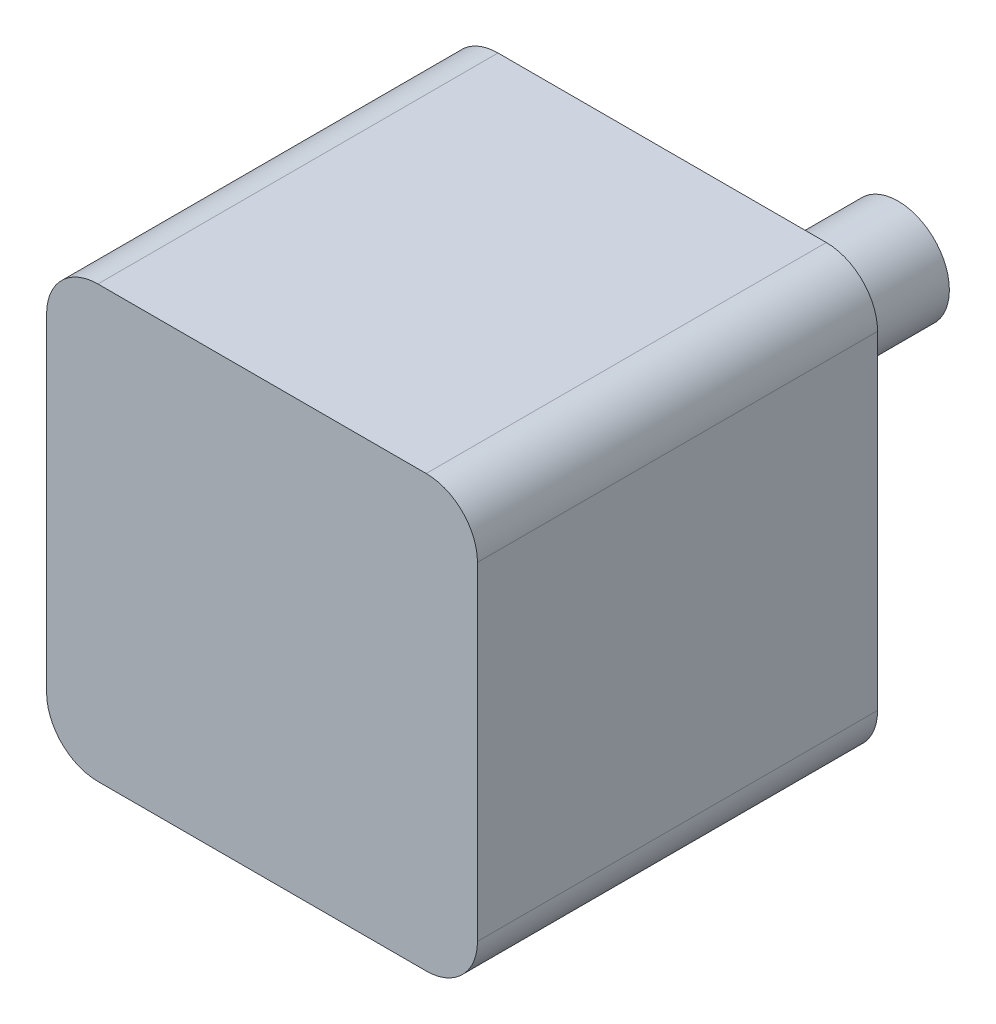
ISO-10303-21;
HEADER;
FILE_DESCRIPTION(('STEP AP214'),'2;1');
FILE_NAME('part.step','',(''),(''),'','','');
FILE_SCHEMA(('AUTOMOTIVE_DESIGN { 1 0 10303 214 1 1 1 1 }'));
ENDSEC;
DATA;
#1=APPLICATION_CONTEXT('core data for automotive mechanical design processes');
#2=APPLICATION_PROTOCOL_DEFINITION('international standard','automotive_design',2000,#1);
#3=PRODUCT_CONTEXT('',#1,'mechanical');
#4=PRODUCT('Part','Part','',(#3));
#5=PRODUCT_RELATED_PRODUCT_CATEGORY('part','',(#4));
#6=PRODUCT_DEFINITION_FORMATION('','',#4);
#7=PRODUCT_DEFINITION_CONTEXT('part definition',#1,'design');
#8=PRODUCT_DEFINITION('design','',#6,#7);
#9=PRODUCT_DEFINITION_SHAPE('','',#8);
#10=(LENGTH_UNIT() NAMED_UNIT(*) SI_UNIT(.MILLI.,.METRE.));
#11=(NAMED_UNIT(*) PLANE_ANGLE_UNIT() SI_UNIT($,.RADIAN.));
#12=(NAMED_UNIT(*) SI_UNIT($,.STERADIAN.) SOLID_ANGLE_UNIT());
#13=UNCERTAINTY_MEASURE_WITH_UNIT(LENGTH_MEASURE(1.E-05),#10,'distance_accuracy_value','');
#14=(GEOMETRIC_REPRESENTATION_CONTEXT(3) GLOBAL_UNCERTAINTY_ASSIGNED_CONTEXT((#13)) GLOBAL_UNIT_ASSIGNED_CONTEXT((#10,
#11,#12)) REPRESENTATION_CONTEXT('',''));
#15=CARTESIAN_POINT('',(0.,0.,0.));
#16=DIRECTION('',(0.,0.,1.));
#17=DIRECTION('',(1.,0.,0.));
#18=AXIS2_PLACEMENT_3D('',#15,#16,#17);
#19=CARTESIAN_POINT('',(0.,0.,0.));
#20=DIRECTION('',(0.,0.,1.));
#21=DIRECTION('',(1.,0.,0.));
#22=AXIS2_PLACEMENT_3D('',#19,#20,#21);
#23=PLANE('',#22);
#24=DIRECTION('',(0.,1.,0.));
#25=VECTOR('',#24,1.);
#26=CARTESIAN_POINT('',(42.,0.,0.));
#27=LINE('',#26,#25);
#28=CARTESIAN_POINT('',(42.,-37.,0.));
#29=VERTEX_POINT('',#28);
#30=CARTESIAN_POINT('',(42.,-5.,0.));
#31=VERTEX_POINT('',#30);
#32=EDGE_CURVE('E116',#29,#31,#27,.T.);
#33=ORIENTED_EDGE('',*,*,#32,.F.);
#34=CARTESIAN_POINT('',(37.,-37.,0.));
#35=DIRECTION('',(0.,0.,1.));
#36=DIRECTION('',(1.,0.,0.));
#37=AXIS2_PLACEMENT_3D('',#34,#35,#36);
#38=CIRCLE('',#37,5.);
#39=CARTESIAN_POINT('',(37.,-42.,0.));
#40=VERTEX_POINT('',#39);
#41=EDGE_CURVE('E99',#29,#40,#38,.F.);
#42=ORIENTED_EDGE('',*,*,#41,.T.);
#43=DIRECTION('',(1.,0.,0.));
#44=VECTOR('',#43,1.);
#45=CARTESIAN_POINT('',(0.,-42.,0.));
#46=LINE('',#45,#44);
#47=CARTESIAN_POINT('',(5.,-42.,0.));
#48=VERTEX_POINT('',#47);
#49=EDGE_CURVE('E125',#48,#40,#46,.T.);
#50=ORIENTED_EDGE('',*,*,#49,.F.);
#51=CARTESIAN_POINT('',(5.,-37.,0.));
#52=DIRECTION('',(0.,0.,1.));
#53=DIRECTION('',(1.,0.,0.));
#54=AXIS2_PLACEMENT_3D('',#51,#52,#53);
#55=CIRCLE('',#54,5.);
#56=CARTESIAN_POINT('',(0.,-37.,0.));
#57=VERTEX_POINT('',#56);
#58=EDGE_CURVE('E110',#48,#57,#55,.F.);
#59=ORIENTED_EDGE('',*,*,#58,.T.);
#60=DIRECTION('',(0.,-1.,0.));
#61=VECTOR('',#60,1.);
#62=CARTESIAN_POINT('',(0.,0.,0.));
#63=LINE('',#62,#61);
#64=CARTESIAN_POINT('',(0.,-5.,0.));
#65=VERTEX_POINT('',#64);
#66=EDGE_CURVE('E129',#65,#57,#63,.T.);
#67=ORIENTED_EDGE('',*,*,#66,.F.);
#68=CARTESIAN_POINT('',(5.,-5.,0.));
#69=DIRECTION('',(0.,0.,1.));
#70=DIRECTION('',(1.,0.,0.));
#71=AXIS2_PLACEMENT_3D('',#68,#69,#70);
#72=CIRCLE('',#71,5.);
#73=CARTESIAN_POINT('',(5.,0.,0.));
#74=VERTEX_POINT('',#73);
#75=EDGE_CURVE('E136',#65,#74,#72,.F.);
#76=ORIENTED_EDGE('',*,*,#75,.T.);
#77=DIRECTION('',(-1.,0.,0.));
#78=VECTOR('',#77,1.);
#79=CARTESIAN_POINT('',(0.,0.,0.));
#80=LINE('',#79,#78);
#81=CARTESIAN_POINT('',(37.,0.,0.));
#82=VERTEX_POINT('',#81);
#83=EDGE_CURVE('E124',#82,#74,#80,.T.);
#84=ORIENTED_EDGE('',*,*,#83,.F.);
#85=CARTESIAN_POINT('',(37.,-5.,0.));
#86=DIRECTION('',(0.,0.,1.));
#87=DIRECTION('',(1.,0.,0.));
#88=AXIS2_PLACEMENT_3D('',#85,#86,#87);
#89=CIRCLE('',#88,5.);
#90=EDGE_CURVE('E119',#82,#31,#89,.F.);
#91=ORIENTED_EDGE('',*,*,#90,.T.);
#92=EDGE_LOOP('',(#33,#42,#50,#59,#67,#76,#84,#91));
#93=FACE_BOUND('',#92,.T.);
#94=CARTESIAN_POINT('',(21.,-21.,0.));
#95=DIRECTION('',(0.,0.,1.));
#96=DIRECTION('',(1.,0.,0.));
#97=AXIS2_PLACEMENT_3D('',#94,#95,#96);
#98=CIRCLE('',#97,5.);
#99=CARTESIAN_POINT('',(26.,-21.,0.));
#100=VERTEX_POINT('',#99);
#101=EDGE_CURVE('E11',#100,#100,#98,.F.);
#102=ORIENTED_EDGE('',*,*,#101,.F.);
#103=EDGE_LOOP('',(#102));
#104=FACE_BOUND('',#103,.T.);
#105=ADVANCED_FACE('F33',(#93,#104),#23,.F.);
#106=CARTESIAN_POINT('',(0.,0.,39.));
#107=DIRECTION('',(1.,0.,0.));
#108=DIRECTION('',(0.,1.,0.));
#109=AXIS2_PLACEMENT_3D('',#106,#107,#108);
#110=PLANE('',#109);
#111=ORIENTED_EDGE('',*,*,#66,.T.);
#112=DIRECTION('',(0.,0.,-1.));
#113=VECTOR('',#112,1.);
#114=CARTESIAN_POINT('',(0.,-37.,39.));
#115=LINE('',#114,#113);
#116=CARTESIAN_POINT('',(0.,-37.,39.));
#117=VERTEX_POINT('',#116);
#118=EDGE_CURVE('E152',#57,#117,#115,.F.);
#119=ORIENTED_EDGE('',*,*,#118,.T.);
#120=DIRECTION('',(0.,-1.,0.));
#121=VECTOR('',#120,1.);
#122=CARTESIAN_POINT('',(0.,0.,39.));
#123=LINE('',#122,#121);
#124=CARTESIAN_POINT('',(0.,-5.,39.));
#125=VERTEX_POINT('',#124);
#126=EDGE_CURVE('E127',#125,#117,#123,.T.);
#127=ORIENTED_EDGE('',*,*,#126,.F.);
#128=DIRECTION('',(0.,0.,-1.));
#129=VECTOR('',#128,1.);
#130=CARTESIAN_POINT('',(0.,-5.,39.));
#131=LINE('',#130,#129);
#132=EDGE_CURVE('E149',#125,#65,#131,.T.);
#133=ORIENTED_EDGE('',*,*,#132,.T.);
#134=EDGE_LOOP('',(#111,#119,#127,#133));
#135=FACE_BOUND('',#134,.T.);
#136=ADVANCED_FACE('F167',(#135),#110,.F.);
#137=CARTESIAN_POINT('',(0.,-42.,39.));
#138=DIRECTION('',(0.,1.,0.));
#139=DIRECTION('',(0.,0.,1.));
#140=AXIS2_PLACEMENT_3D('',#137,#138,#139);
#141=PLANE('',#140);
#142=ORIENTED_EDGE('',*,*,#49,.T.);
#143=DIRECTION('',(0.,0.,-1.));
#144=VECTOR('',#143,1.);
#145=CARTESIAN_POINT('',(37.,-42.,39.));
#146=LINE('',#145,#144);
#147=CARTESIAN_POINT('',(37.,-42.,39.));
#148=VERTEX_POINT('',#147);
#149=EDGE_CURVE('E104',#40,#148,#146,.F.);
#150=ORIENTED_EDGE('',*,*,#149,.T.);
#151=DIRECTION('',(1.,0.,0.));
#152=VECTOR('',#151,1.);
#153=CARTESIAN_POINT('',(0.,-42.,39.));
#154=LINE('',#153,#152);
#155=CARTESIAN_POINT('',(5.,-42.,39.));
#156=VERTEX_POINT('',#155);
#157=EDGE_CURVE('E171',#156,#148,#154,.T.);
#158=ORIENTED_EDGE('',*,*,#157,.F.);
#159=DIRECTION('',(0.,0.,-1.));
#160=VECTOR('',#159,1.);
#161=CARTESIAN_POINT('',(5.,-42.,39.));
#162=LINE('',#161,#160);
#163=EDGE_CURVE('E109',#156,#48,#162,.T.);
#164=ORIENTED_EDGE('',*,*,#163,.T.);
#165=EDGE_LOOP('',(#142,#150,#158,#164));
#166=FACE_BOUND('',#165,.T.);
#167=ADVANCED_FACE('F194',(#166),#141,.F.);
#168=CARTESIAN_POINT('',(42.,0.,39.));
#169=DIRECTION('',(-1.,0.,0.));
#170=DIRECTION('',(0.,-1.,0.));
#171=AXIS2_PLACEMENT_3D('',#168,#169,#170);
#172=PLANE('',#171);
#173=DIRECTION('',(0.,1.,0.));
#174=VECTOR('',#173,1.);
#175=CARTESIAN_POINT('',(42.,0.,39.));
#176=LINE('',#175,#174);
#177=CARTESIAN_POINT('',(42.,-37.,39.));
#178=VERTEX_POINT('',#177);
#179=CARTESIAN_POINT('',(42.,-5.,39.));
#180=VERTEX_POINT('',#179);
#181=EDGE_CURVE('E118',#178,#180,#176,.T.);
#182=ORIENTED_EDGE('',*,*,#181,.F.);
#183=DIRECTION('',(0.,0.,-1.));
#184=VECTOR('',#183,1.);
#185=CARTESIAN_POINT('',(42.,-37.,39.));
#186=LINE('',#185,#184);
#187=EDGE_CURVE('E103',#178,#29,#186,.T.);
#188=ORIENTED_EDGE('',*,*,#187,.T.);
#189=ORIENTED_EDGE('',*,*,#32,.T.);
#190=DIRECTION('',(0.,0.,-1.));
#191=VECTOR('',#190,1.);
#192=CARTESIAN_POINT('',(42.,-5.,39.));
#193=LINE('',#192,#191);
#194=EDGE_CURVE('E120',#31,#180,#193,.F.);
#195=ORIENTED_EDGE('',*,*,#194,.T.);
#196=EDGE_LOOP('',(#182,#188,#189,#195));
#197=FACE_BOUND('',#196,.T.);
#198=ADVANCED_FACE('F115',(#197),#172,.F.);
#199=CARTESIAN_POINT('',(0.,0.,39.));
#200=DIRECTION('',(0.,-1.,0.));
#201=DIRECTION('',(0.,0.,-1.));
#202=AXIS2_PLACEMENT_3D('',#199,#200,#201);
#203=PLANE('',#202);
#204=ORIENTED_EDGE('',*,*,#83,.T.);
#205=DIRECTION('',(0.,0.,-1.));
#206=VECTOR('',#205,1.);
#207=CARTESIAN_POINT('',(5.,0.,39.));
#208=LINE('',#207,#206);
#209=CARTESIAN_POINT('',(5.,0.,39.));
#210=VERTEX_POINT('',#209);
#211=EDGE_CURVE('E41',#74,#210,#208,.F.);
#212=ORIENTED_EDGE('',*,*,#211,.T.);
#213=DIRECTION('',(-1.,0.,0.));
#214=VECTOR('',#213,1.);
#215=CARTESIAN_POINT('',(0.,0.,39.));
#216=LINE('',#215,#214);
#217=CARTESIAN_POINT('',(37.,0.,39.));
#218=VERTEX_POINT('',#217);
#219=EDGE_CURVE('E133',#218,#210,#216,.T.);
#220=ORIENTED_EDGE('',*,*,#219,.F.);
#221=DIRECTION('',(0.,0.,-1.));
#222=VECTOR('',#221,1.);
#223=CARTESIAN_POINT('',(37.,0.,39.));
#224=LINE('',#223,#222);
#225=EDGE_CURVE('E154',#218,#82,#224,.T.);
#226=ORIENTED_EDGE('',*,*,#225,.T.);
#227=EDGE_LOOP('',(#204,#212,#220,#226));
#228=FACE_BOUND('',#227,.T.);
#229=ADVANCED_FACE('F157',(#228),#203,.F.);
#230=CARTESIAN_POINT('',(0.,0.,39.));
#231=DIRECTION('',(0.,0.,1.));
#232=DIRECTION('',(1.,0.,0.));
#233=AXIS2_PLACEMENT_3D('',#230,#231,#232);
#234=PLANE('',#233);
#235=ORIENTED_EDGE('',*,*,#157,.T.);
#236=CARTESIAN_POINT('',(37.,-37.,39.));
#237=DIRECTION('',(0.,0.,1.));
#238=DIRECTION('',(1.,0.,0.));
#239=AXIS2_PLACEMENT_3D('',#236,#237,#238);
#240=CIRCLE('',#239,5.);
#241=EDGE_CURVE('E147',#148,#178,#240,.T.);
#242=ORIENTED_EDGE('',*,*,#241,.T.);
#243=ORIENTED_EDGE('',*,*,#181,.T.);
#244=CARTESIAN_POINT('',(37.,-5.,39.));
#245=DIRECTION('',(0.,0.,1.));
#246=DIRECTION('',(1.,0.,0.));
#247=AXIS2_PLACEMENT_3D('',#244,#245,#246);
#248=CIRCLE('',#247,5.);
#249=EDGE_CURVE('E54',#180,#218,#248,.T.);
#250=ORIENTED_EDGE('',*,*,#249,.T.);
#251=ORIENTED_EDGE('',*,*,#219,.T.);
#252=CARTESIAN_POINT('',(5.,-5.,39.));
#253=DIRECTION('',(0.,0.,1.));
#254=DIRECTION('',(1.,0.,0.));
#255=AXIS2_PLACEMENT_3D('',#252,#253,#254);
#256=CIRCLE('',#255,5.);
#257=EDGE_CURVE('E143',#210,#125,#256,.T.);
#258=ORIENTED_EDGE('',*,*,#257,.T.);
#259=ORIENTED_EDGE('',*,*,#126,.T.);
#260=CARTESIAN_POINT('',(5.,-37.,39.));
#261=DIRECTION('',(0.,0.,1.));
#262=DIRECTION('',(1.,0.,0.));
#263=AXIS2_PLACEMENT_3D('',#260,#261,#262);
#264=CIRCLE('',#263,5.);
#265=EDGE_CURVE('E145',#117,#156,#264,.T.);
#266=ORIENTED_EDGE('',*,*,#265,.T.);
#267=EDGE_LOOP('',(#235,#242,#243,#250,#251,#258,#259,#266));
#268=FACE_BOUND('',#267,.T.);
#269=ADVANCED_FACE('F198',(#268),#234,.T.);
#270=CARTESIAN_POINT('',(37.,-37.,39.));
#271=DIRECTION('',(0.,0.,-1.));
#272=DIRECTION('',(-1.,0.,0.));
#273=AXIS2_PLACEMENT_3D('',#270,#271,#272);
#274=CYLINDRICAL_SURFACE('',#273,5.);
#275=ORIENTED_EDGE('',*,*,#241,.F.);
#276=ORIENTED_EDGE('',*,*,#149,.F.);
#277=ORIENTED_EDGE('',*,*,#41,.F.);
#278=ORIENTED_EDGE('',*,*,#187,.F.);
#279=EDGE_LOOP('',(#275,#276,#277,#278));
#280=FACE_BOUND('',#279,.T.);
#281=ADVANCED_FACE('F102',(#280),#274,.T.);
#282=CARTESIAN_POINT('',(5.,-37.,39.));
#283=DIRECTION('',(0.,0.,-1.));
#284=DIRECTION('',(-1.,0.,0.));
#285=AXIS2_PLACEMENT_3D('',#282,#283,#284);
#286=CYLINDRICAL_SURFACE('',#285,5.);
#287=ORIENTED_EDGE('',*,*,#265,.F.);
#288=ORIENTED_EDGE('',*,*,#118,.F.);
#289=ORIENTED_EDGE('',*,*,#58,.F.);
#290=ORIENTED_EDGE('',*,*,#163,.F.);
#291=EDGE_LOOP('',(#287,#288,#289,#290));
#292=FACE_BOUND('',#291,.T.);
#293=ADVANCED_FACE('F208',(#292),#286,.T.);
#294=CARTESIAN_POINT('',(5.,-5.,39.));
#295=DIRECTION('',(0.,0.,-1.));
#296=DIRECTION('',(-1.,0.,0.));
#297=AXIS2_PLACEMENT_3D('',#294,#295,#296);
#298=CYLINDRICAL_SURFACE('',#297,5.);
#299=ORIENTED_EDGE('',*,*,#257,.F.);
#300=ORIENTED_EDGE('',*,*,#211,.F.);
#301=ORIENTED_EDGE('',*,*,#75,.F.);
#302=ORIENTED_EDGE('',*,*,#132,.F.);
#303=EDGE_LOOP('',(#299,#300,#301,#302));
#304=FACE_BOUND('',#303,.T.);
#305=ADVANCED_FACE('F164',(#304),#298,.T.);
#306=CARTESIAN_POINT('',(37.,-5.,39.));
#307=DIRECTION('',(0.,0.,-1.));
#308=DIRECTION('',(-1.,0.,0.));
#309=AXIS2_PLACEMENT_3D('',#306,#307,#308);
#310=CYLINDRICAL_SURFACE('',#309,5.);
#311=ORIENTED_EDGE('',*,*,#249,.F.);
#312=ORIENTED_EDGE('',*,*,#194,.F.);
#313=ORIENTED_EDGE('',*,*,#90,.F.);
#314=ORIENTED_EDGE('',*,*,#225,.F.);
#315=EDGE_LOOP('',(#311,#312,#313,#314));
#316=FACE_BOUND('',#315,.T.);
#317=ADVANCED_FACE('F35',(#316),#310,.T.);
#318=CARTESIAN_POINT('',(21.,-21.,-23.));
#319=DIRECTION('',(0.,0.,1.));
#320=DIRECTION('',(1.,0.,0.));
#321=AXIS2_PLACEMENT_3D('',#318,#319,#320);
#322=CYLINDRICAL_SURFACE('',#321,5.);
#323=CARTESIAN_POINT('',(21.,-21.,-23.));
#324=DIRECTION('',(0.,0.,-1.));
#325=DIRECTION('',(-1.,0.,0.));
#326=AXIS2_PLACEMENT_3D('',#323,#324,#325);
#327=CIRCLE('',#326,5.);
#328=CARTESIAN_POINT('',(16.,-21.,-23.));
#329=VERTEX_POINT('',#328);
#330=EDGE_CURVE('E176',#329,#329,#327,.T.);
#331=ORIENTED_EDGE('',*,*,#330,.F.);
#332=EDGE_LOOP('',(#331));
#333=FACE_BOUND('',#332,.T.);
#334=ORIENTED_EDGE('',*,*,#101,.T.);
#335=EDGE_LOOP('',(#334));
#336=FACE_BOUND('',#335,.T.);
#337=ADVANCED_FACE('F184',(#333,#336),#322,.T.);
#338=CARTESIAN_POINT('',(21.,-21.,-23.));
#339=DIRECTION('',(0.,0.,-1.));
#340=DIRECTION('',(-1.,0.,0.));
#341=AXIS2_PLACEMENT_3D('',#338,#339,#340);
#342=PLANE('',#341);
#343=ORIENTED_EDGE('',*,*,#330,.T.);
#344=EDGE_LOOP('',(#343));
#345=FACE_BOUND('',#344,.T.);
#346=ADVANCED_FACE('F182',(#345),#342,.T.);
#347=CLOSED_SHELL('',(#105,#136,#167,#198,#229,#269,#281,#293,#305,#317,#337,#346));
#348=MANIFOLD_SOLID_BREP('B2',#347);
#349=ADVANCED_BREP_SHAPE_REPRESENTATION('',(#18,#348),#14);
#350=SHAPE_DEFINITION_REPRESENTATION(#9,#349);
ENDSEC;
END-ISO-10303-21;
